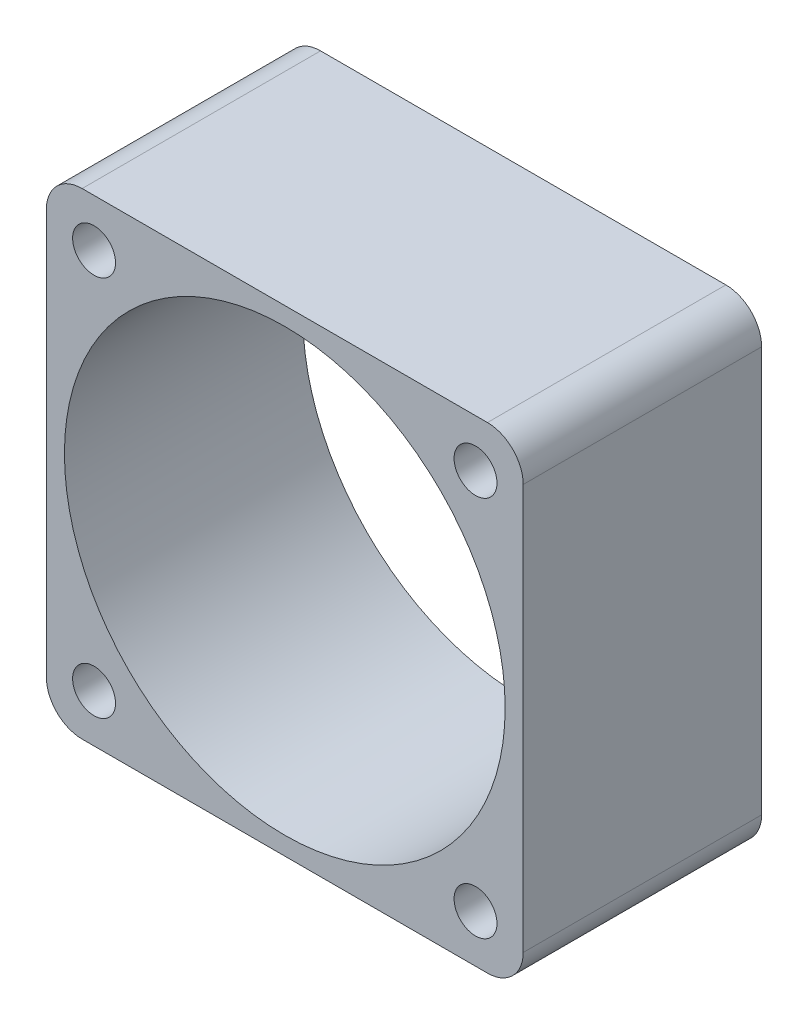
ISO-10303-21;
HEADER;
FILE_DESCRIPTION(('STEP AP214'),'2;1');
FILE_NAME('part.step','',(''),(''),'','','');
FILE_SCHEMA(('AUTOMOTIVE_DESIGN { 1 0 10303 214 1 1 1 1 }'));
ENDSEC;
DATA;
#1=APPLICATION_CONTEXT('core data for automotive mechanical design processes');
#2=APPLICATION_PROTOCOL_DEFINITION('international standard','automotive_design',2000,#1);
#3=PRODUCT_CONTEXT('',#1,'mechanical');
#4=PRODUCT('Part','Part','',(#3));
#5=PRODUCT_RELATED_PRODUCT_CATEGORY('part','',(#4));
#6=PRODUCT_DEFINITION_FORMATION('','',#4);
#7=PRODUCT_DEFINITION_CONTEXT('part definition',#1,'design');
#8=PRODUCT_DEFINITION('design','',#6,#7);
#9=PRODUCT_DEFINITION_SHAPE('','',#8);
#10=(LENGTH_UNIT() NAMED_UNIT(*) SI_UNIT(.MILLI.,.METRE.));
#11=(NAMED_UNIT(*) PLANE_ANGLE_UNIT() SI_UNIT($,.RADIAN.));
#12=(NAMED_UNIT(*) SI_UNIT($,.STERADIAN.) SOLID_ANGLE_UNIT());
#13=UNCERTAINTY_MEASURE_WITH_UNIT(LENGTH_MEASURE(1.E-05),#10,'distance_accuracy_value','');
#14=(GEOMETRIC_REPRESENTATION_CONTEXT(3) GLOBAL_UNCERTAINTY_ASSIGNED_CONTEXT((#13)) GLOBAL_UNIT_ASSIGNED_CONTEXT((#10,
#11,#12)) REPRESENTATION_CONTEXT('',''));
#15=CARTESIAN_POINT('',(0.,0.,0.));
#16=DIRECTION('',(0.,0.,1.));
#17=DIRECTION('',(1.,0.,0.));
#18=AXIS2_PLACEMENT_3D('',#15,#16,#17);
#19=CARTESIAN_POINT('',(0.,0.,20.));
#20=DIRECTION('',(0.,0.,-1.));
#21=DIRECTION('',(-1.,0.,0.));
#22=AXIS2_PLACEMENT_3D('',#19,#20,#21);
#23=PLANE('',#22);
#24=DIRECTION('',(1.,0.,0.));
#25=VECTOR('',#24,1.);
#26=CARTESIAN_POINT('',(-20.,-20.,20.));
#27=LINE('',#26,#25);
#28=CARTESIAN_POINT('',(-17.,-20.,20.));
#29=VERTEX_POINT('',#28);
#30=CARTESIAN_POINT('',(17.,-20.,20.));
#31=VERTEX_POINT('',#30);
#32=EDGE_CURVE('E136',#29,#31,#27,.T.);
#33=ORIENTED_EDGE('',*,*,#32,.T.);
#34=CARTESIAN_POINT('',(17.,-17.,20.));
#35=DIRECTION('',(0.,0.,-1.));
#36=DIRECTION('',(-1.,0.,0.));
#37=AXIS2_PLACEMENT_3D('',#34,#35,#36);
#38=CIRCLE('',#37,3.);
#39=CARTESIAN_POINT('',(20.,-17.,20.));
#40=VERTEX_POINT('',#39);
#41=EDGE_CURVE('E155',#31,#40,#38,.F.);
#42=ORIENTED_EDGE('',*,*,#41,.T.);
#43=DIRECTION('',(0.,1.,0.));
#44=VECTOR('',#43,1.);
#45=CARTESIAN_POINT('',(20.,-20.,20.));
#46=LINE('',#45,#44);
#47=CARTESIAN_POINT('',(20.,17.,20.));
#48=VERTEX_POINT('',#47);
#49=EDGE_CURVE('E119',#40,#48,#46,.T.);
#50=ORIENTED_EDGE('',*,*,#49,.T.);
#51=CARTESIAN_POINT('',(17.,17.,20.));
#52=DIRECTION('',(0.,0.,-1.));
#53=DIRECTION('',(-1.,0.,0.));
#54=AXIS2_PLACEMENT_3D('',#51,#52,#53);
#55=CIRCLE('',#54,3.);
#56=CARTESIAN_POINT('',(17.,20.,20.));
#57=VERTEX_POINT('',#56);
#58=EDGE_CURVE('E150',#48,#57,#55,.F.);
#59=ORIENTED_EDGE('',*,*,#58,.T.);
#60=DIRECTION('',(-1.,0.,0.));
#61=VECTOR('',#60,1.);
#62=CARTESIAN_POINT('',(-20.,20.,20.));
#63=LINE('',#62,#61);
#64=CARTESIAN_POINT('',(-17.,20.,20.));
#65=VERTEX_POINT('',#64);
#66=EDGE_CURVE('E166',#57,#65,#63,.T.);
#67=ORIENTED_EDGE('',*,*,#66,.T.);
#68=CARTESIAN_POINT('',(-17.,17.,20.));
#69=DIRECTION('',(0.,0.,-1.));
#70=DIRECTION('',(-1.,0.,0.));
#71=AXIS2_PLACEMENT_3D('',#68,#69,#70);
#72=CIRCLE('',#71,3.);
#73=CARTESIAN_POINT('',(-20.,17.,20.));
#74=VERTEX_POINT('',#73);
#75=EDGE_CURVE('E55',#65,#74,#72,.F.);
#76=ORIENTED_EDGE('',*,*,#75,.T.);
#77=DIRECTION('',(0.,-1.,0.));
#78=VECTOR('',#77,1.);
#79=CARTESIAN_POINT('',(-20.,-20.,20.));
#80=LINE('',#79,#78);
#81=CARTESIAN_POINT('',(-20.,-17.,20.));
#82=VERTEX_POINT('',#81);
#83=EDGE_CURVE('E174',#74,#82,#80,.T.);
#84=ORIENTED_EDGE('',*,*,#83,.T.);
#85=CARTESIAN_POINT('',(-17.,-17.,20.));
#86=DIRECTION('',(0.,0.,-1.));
#87=DIRECTION('',(-1.,0.,0.));
#88=AXIS2_PLACEMENT_3D('',#85,#86,#87);
#89=CIRCLE('',#88,3.);
#90=EDGE_CURVE('E153',#82,#29,#89,.F.);
#91=ORIENTED_EDGE('',*,*,#90,.T.);
#92=EDGE_LOOP('',(#33,#42,#50,#59,#67,#76,#84,#91));
#93=FACE_BOUND('',#92,.T.);
#94=CARTESIAN_POINT('',(-16.,16.,20.));
#95=DIRECTION('',(0.,0.,1.));
#96=DIRECTION('',(1.,0.,0.));
#97=AXIS2_PLACEMENT_3D('',#94,#95,#96);
#98=CIRCLE('',#97,1.8);
#99=CARTESIAN_POINT('',(-14.2,16.,20.));
#100=VERTEX_POINT('',#99);
#101=EDGE_CURVE('E127',#100,#100,#98,.T.);
#102=ORIENTED_EDGE('',*,*,#101,.F.);
#103=EDGE_LOOP('',(#102));
#104=FACE_BOUND('',#103,.T.);
#105=CARTESIAN_POINT('',(0.,0.,20.));
#106=DIRECTION('',(0.,0.,1.));
#107=DIRECTION('',(1.,0.,0.));
#108=AXIS2_PLACEMENT_3D('',#105,#106,#107);
#109=CIRCLE('',#108,18.4844631894181);
#110=CARTESIAN_POINT('',(18.4844631894181,0.,20.));
#111=VERTEX_POINT('',#110);
#112=EDGE_CURVE('E181',#111,#111,#109,.T.);
#113=ORIENTED_EDGE('',*,*,#112,.F.);
#114=EDGE_LOOP('',(#113));
#115=FACE_BOUND('',#114,.T.);
#116=CARTESIAN_POINT('',(16.,16.0000000000009,20.));
#117=DIRECTION('',(0.,0.,1.));
#118=DIRECTION('',(1.,0.,0.));
#119=AXIS2_PLACEMENT_3D('',#116,#117,#118);
#120=CIRCLE('',#119,1.80000000000092);
#121=CARTESIAN_POINT('',(17.8000000000009,16.0000000000009,20.));
#122=VERTEX_POINT('',#121);
#123=EDGE_CURVE('E186',#122,#122,#120,.T.);
#124=ORIENTED_EDGE('',*,*,#123,.F.);
#125=EDGE_LOOP('',(#124));
#126=FACE_BOUND('',#125,.T.);
#127=CARTESIAN_POINT('',(16.0000000000009,-15.9999999999991,20.));
#128=DIRECTION('',(0.,0.,1.));
#129=DIRECTION('',(1.,0.,0.));
#130=AXIS2_PLACEMENT_3D('',#127,#128,#129);
#131=CIRCLE('',#130,1.80000000000125);
#132=CARTESIAN_POINT('',(17.8000000000022,-15.9999999999991,20.));
#133=VERTEX_POINT('',#132);
#134=EDGE_CURVE('E192',#133,#133,#131,.T.);
#135=ORIENTED_EDGE('',*,*,#134,.F.);
#136=EDGE_LOOP('',(#135));
#137=FACE_BOUND('',#136,.T.);
#138=CARTESIAN_POINT('',(-15.9999999999991,-16.,20.));
#139=DIRECTION('',(0.,0.,1.));
#140=DIRECTION('',(1.,0.,0.));
#141=AXIS2_PLACEMENT_3D('',#138,#139,#140);
#142=CIRCLE('',#141,1.80000000000047);
#143=CARTESIAN_POINT('',(-14.1999999999986,-16.,20.));
#144=VERTEX_POINT('',#143);
#145=EDGE_CURVE('E198',#144,#144,#142,.T.);
#146=ORIENTED_EDGE('',*,*,#145,.F.);
#147=EDGE_LOOP('',(#146));
#148=FACE_BOUND('',#147,.T.);
#149=ADVANCED_FACE('F33',(#93,#104,#115,#126,#137,#148),#23,.F.);
#150=CARTESIAN_POINT('',(0.,0.,0.));
#151=DIRECTION('',(0.,0.,-1.));
#152=DIRECTION('',(-1.,0.,0.));
#153=AXIS2_PLACEMENT_3D('',#150,#151,#152);
#154=PLANE('',#153);
#155=CARTESIAN_POINT('',(16.0000000000009,-15.9999999999991,0.));
#156=DIRECTION('',(0.,0.,1.));
#157=DIRECTION('',(1.,0.,0.));
#158=AXIS2_PLACEMENT_3D('',#155,#156,#157);
#159=CIRCLE('',#158,1.80000000000125);
#160=CARTESIAN_POINT('',(17.8000000000022,-15.9999999999991,0.));
#161=VERTEX_POINT('',#160);
#162=EDGE_CURVE('E195',#161,#161,#159,.T.);
#163=ORIENTED_EDGE('',*,*,#162,.T.);
#164=EDGE_LOOP('',(#163));
#165=FACE_BOUND('',#164,.T.);
#166=CARTESIAN_POINT('',(0.,0.,0.));
#167=DIRECTION('',(0.,0.,1.));
#168=DIRECTION('',(1.,0.,0.));
#169=AXIS2_PLACEMENT_3D('',#166,#167,#168);
#170=CIRCLE('',#169,18.4844631894181);
#171=CARTESIAN_POINT('',(18.4844631894181,0.,0.));
#172=VERTEX_POINT('',#171);
#173=EDGE_CURVE('E183',#172,#172,#170,.T.);
#174=ORIENTED_EDGE('',*,*,#173,.T.);
#175=EDGE_LOOP('',(#174));
#176=FACE_BOUND('',#175,.T.);
#177=DIRECTION('',(0.,1.,0.));
#178=VECTOR('',#177,1.);
#179=CARTESIAN_POINT('',(20.,-20.,0.));
#180=LINE('',#179,#178);
#181=CARTESIAN_POINT('',(20.,-17.,0.));
#182=VERTEX_POINT('',#181);
#183=CARTESIAN_POINT('',(20.,17.,0.));
#184=VERTEX_POINT('',#183);
#185=EDGE_CURVE('E116',#182,#184,#180,.T.);
#186=ORIENTED_EDGE('',*,*,#185,.F.);
#187=CARTESIAN_POINT('',(17.,-17.,0.));
#188=DIRECTION('',(0.,0.,-1.));
#189=DIRECTION('',(-1.,0.,0.));
#190=AXIS2_PLACEMENT_3D('',#187,#188,#189);
#191=CIRCLE('',#190,3.);
#192=CARTESIAN_POINT('',(17.,-20.,0.));
#193=VERTEX_POINT('',#192);
#194=EDGE_CURVE('E99',#182,#193,#191,.T.);
#195=ORIENTED_EDGE('',*,*,#194,.T.);
#196=DIRECTION('',(1.,0.,0.));
#197=VECTOR('',#196,1.);
#198=CARTESIAN_POINT('',(-20.,-20.,0.));
#199=LINE('',#198,#197);
#200=CARTESIAN_POINT('',(-17.,-20.,0.));
#201=VERTEX_POINT('',#200);
#202=EDGE_CURVE('E140',#201,#193,#199,.T.);
#203=ORIENTED_EDGE('',*,*,#202,.F.);
#204=CARTESIAN_POINT('',(-17.,-17.,0.));
#205=DIRECTION('',(0.,0.,-1.));
#206=DIRECTION('',(-1.,0.,0.));
#207=AXIS2_PLACEMENT_3D('',#204,#205,#206);
#208=CIRCLE('',#207,3.);
#209=CARTESIAN_POINT('',(-20.,-17.,0.));
#210=VERTEX_POINT('',#209);
#211=EDGE_CURVE('E110',#201,#210,#208,.T.);
#212=ORIENTED_EDGE('',*,*,#211,.T.);
#213=DIRECTION('',(0.,-1.,0.));
#214=VECTOR('',#213,1.);
#215=CARTESIAN_POINT('',(-20.,-20.,0.));
#216=LINE('',#215,#214);
#217=CARTESIAN_POINT('',(-20.,17.,0.));
#218=VERTEX_POINT('',#217);
#219=EDGE_CURVE('E130',#218,#210,#216,.T.);
#220=ORIENTED_EDGE('',*,*,#219,.F.);
#221=CARTESIAN_POINT('',(-17.,17.,0.));
#222=DIRECTION('',(0.,0.,-1.));
#223=DIRECTION('',(-1.,0.,0.));
#224=AXIS2_PLACEMENT_3D('',#221,#222,#223);
#225=CIRCLE('',#224,3.);
#226=CARTESIAN_POINT('',(-17.,20.,0.));
#227=VERTEX_POINT('',#226);
#228=EDGE_CURVE('E144',#218,#227,#225,.T.);
#229=ORIENTED_EDGE('',*,*,#228,.T.);
#230=DIRECTION('',(-1.,0.,0.));
#231=VECTOR('',#230,1.);
#232=CARTESIAN_POINT('',(-20.,20.,0.));
#233=LINE('',#232,#231);
#234=CARTESIAN_POINT('',(17.,20.,0.));
#235=VERTEX_POINT('',#234);
#236=EDGE_CURVE('E126',#235,#227,#233,.T.);
#237=ORIENTED_EDGE('',*,*,#236,.F.);
#238=CARTESIAN_POINT('',(17.,17.,0.));
#239=DIRECTION('',(0.,0.,-1.));
#240=DIRECTION('',(-1.,0.,0.));
#241=AXIS2_PLACEMENT_3D('',#238,#239,#240);
#242=CIRCLE('',#241,3.);
#243=EDGE_CURVE('E120',#235,#184,#242,.T.);
#244=ORIENTED_EDGE('',*,*,#243,.T.);
#245=EDGE_LOOP('',(#186,#195,#203,#212,#220,#229,#237,#244));
#246=FACE_BOUND('',#245,.T.);
#247=CARTESIAN_POINT('',(-16.,16.,0.));
#248=DIRECTION('',(0.,0.,1.));
#249=DIRECTION('',(1.,0.,0.));
#250=AXIS2_PLACEMENT_3D('',#247,#248,#249);
#251=CIRCLE('',#250,1.8);
#252=CARTESIAN_POINT('',(-14.2,16.,0.));
#253=VERTEX_POINT('',#252);
#254=EDGE_CURVE('E133',#253,#253,#251,.T.);
#255=ORIENTED_EDGE('',*,*,#254,.T.);
#256=EDGE_LOOP('',(#255));
#257=FACE_BOUND('',#256,.T.);
#258=CARTESIAN_POINT('',(16.,16.0000000000009,0.));
#259=DIRECTION('',(0.,0.,1.));
#260=DIRECTION('',(1.,0.,0.));
#261=AXIS2_PLACEMENT_3D('',#258,#259,#260);
#262=CIRCLE('',#261,1.80000000000092);
#263=CARTESIAN_POINT('',(17.8000000000009,16.0000000000009,0.));
#264=VERTEX_POINT('',#263);
#265=EDGE_CURVE('E189',#264,#264,#262,.T.);
#266=ORIENTED_EDGE('',*,*,#265,.T.);
#267=EDGE_LOOP('',(#266));
#268=FACE_BOUND('',#267,.T.);
#269=CARTESIAN_POINT('',(-15.9999999999991,-16.,0.));
#270=DIRECTION('',(0.,0.,1.));
#271=DIRECTION('',(1.,0.,0.));
#272=AXIS2_PLACEMENT_3D('',#269,#270,#271);
#273=CIRCLE('',#272,1.80000000000047);
#274=CARTESIAN_POINT('',(-14.1999999999986,-16.,0.));
#275=VERTEX_POINT('',#274);
#276=EDGE_CURVE('E201',#275,#275,#273,.T.);
#277=ORIENTED_EDGE('',*,*,#276,.T.);
#278=EDGE_LOOP('',(#277));
#279=FACE_BOUND('',#278,.T.);
#280=ADVANCED_FACE('F123',(#165,#176,#246,#257,#268,#279),#154,.T.);
#281=CARTESIAN_POINT('',(20.,-20.,20.));
#282=DIRECTION('',(-1.,0.,0.));
#283=DIRECTION('',(0.,0.,1.));
#284=AXIS2_PLACEMENT_3D('',#281,#282,#283);
#285=PLANE('',#284);
#286=ORIENTED_EDGE('',*,*,#49,.F.);
#287=DIRECTION('',(0.,0.,-1.));
#288=VECTOR('',#287,1.);
#289=CARTESIAN_POINT('',(20.,-17.,20.));
#290=LINE('',#289,#288);
#291=EDGE_CURVE('E103',#40,#182,#290,.T.);
#292=ORIENTED_EDGE('',*,*,#291,.T.);
#293=ORIENTED_EDGE('',*,*,#185,.T.);
#294=DIRECTION('',(0.,0.,-1.));
#295=VECTOR('',#294,1.);
#296=CARTESIAN_POINT('',(20.,17.,20.));
#297=LINE('',#296,#295);
#298=EDGE_CURVE('E121',#184,#48,#297,.F.);
#299=ORIENTED_EDGE('',*,*,#298,.T.);
#300=EDGE_LOOP('',(#286,#292,#293,#299));
#301=FACE_BOUND('',#300,.T.);
#302=ADVANCED_FACE('F115',(#301),#285,.F.);
#303=CARTESIAN_POINT('',(-20.,20.,20.));
#304=DIRECTION('',(0.,-1.,0.));
#305=DIRECTION('',(0.,0.,-1.));
#306=AXIS2_PLACEMENT_3D('',#303,#304,#305);
#307=PLANE('',#306);
#308=ORIENTED_EDGE('',*,*,#236,.T.);
#309=DIRECTION('',(0.,0.,-1.));
#310=VECTOR('',#309,1.);
#311=CARTESIAN_POINT('',(-17.,20.,20.));
#312=LINE('',#311,#310);
#313=EDGE_CURVE('E11',#227,#65,#312,.F.);
#314=ORIENTED_EDGE('',*,*,#313,.T.);
#315=ORIENTED_EDGE('',*,*,#66,.F.);
#316=DIRECTION('',(0.,0.,-1.));
#317=VECTOR('',#316,1.);
#318=CARTESIAN_POINT('',(17.,20.,20.));
#319=LINE('',#318,#317);
#320=EDGE_CURVE('E41',#57,#235,#319,.T.);
#321=ORIENTED_EDGE('',*,*,#320,.T.);
#322=EDGE_LOOP('',(#308,#314,#315,#321));
#323=FACE_BOUND('',#322,.T.);
#324=ADVANCED_FACE('F164',(#323),#307,.F.);
#325=CARTESIAN_POINT('',(-20.,-20.,20.));
#326=DIRECTION('',(1.,0.,0.));
#327=DIRECTION('',(0.,0.,-1.));
#328=AXIS2_PLACEMENT_3D('',#325,#326,#327);
#329=PLANE('',#328);
#330=ORIENTED_EDGE('',*,*,#219,.T.);
#331=DIRECTION('',(0.,0.,-1.));
#332=VECTOR('',#331,1.);
#333=CARTESIAN_POINT('',(-20.,-17.,20.));
#334=LINE('',#333,#332);
#335=EDGE_CURVE('E48',#210,#82,#334,.F.);
#336=ORIENTED_EDGE('',*,*,#335,.T.);
#337=ORIENTED_EDGE('',*,*,#83,.F.);
#338=DIRECTION('',(0.,0.,-1.));
#339=VECTOR('',#338,1.);
#340=CARTESIAN_POINT('',(-20.,17.,20.));
#341=LINE('',#340,#339);
#342=EDGE_CURVE('E157',#74,#218,#341,.T.);
#343=ORIENTED_EDGE('',*,*,#342,.T.);
#344=EDGE_LOOP('',(#330,#336,#337,#343));
#345=FACE_BOUND('',#344,.T.);
#346=ADVANCED_FACE('F173',(#345),#329,.F.);
#347=CARTESIAN_POINT('',(-20.,-20.,20.));
#348=DIRECTION('',(0.,1.,0.));
#349=DIRECTION('',(0.,0.,1.));
#350=AXIS2_PLACEMENT_3D('',#347,#348,#349);
#351=PLANE('',#350);
#352=ORIENTED_EDGE('',*,*,#202,.T.);
#353=DIRECTION('',(0.,0.,-1.));
#354=VECTOR('',#353,1.);
#355=CARTESIAN_POINT('',(17.,-20.,20.));
#356=LINE('',#355,#354);
#357=EDGE_CURVE('E104',#193,#31,#356,.F.);
#358=ORIENTED_EDGE('',*,*,#357,.T.);
#359=ORIENTED_EDGE('',*,*,#32,.F.);
#360=DIRECTION('',(0.,0.,-1.));
#361=VECTOR('',#360,1.);
#362=CARTESIAN_POINT('',(-17.,-20.,20.));
#363=LINE('',#362,#361);
#364=EDGE_CURVE('E109',#29,#201,#363,.T.);
#365=ORIENTED_EDGE('',*,*,#364,.T.);
#366=EDGE_LOOP('',(#352,#358,#359,#365));
#367=FACE_BOUND('',#366,.T.);
#368=ADVANCED_FACE('F223',(#367),#351,.F.);
#369=CARTESIAN_POINT('',(-16.,16.,20.));
#370=DIRECTION('',(0.,0.,-1.));
#371=DIRECTION('',(-1.,0.,0.));
#372=AXIS2_PLACEMENT_3D('',#369,#370,#371);
#373=CYLINDRICAL_SURFACE('',#372,1.8);
#374=ORIENTED_EDGE('',*,*,#101,.T.);
#375=EDGE_LOOP('',(#374));
#376=FACE_BOUND('',#375,.T.);
#377=ORIENTED_EDGE('',*,*,#254,.F.);
#378=EDGE_LOOP('',(#377));
#379=FACE_BOUND('',#378,.T.);
#380=ADVANCED_FACE('F220',(#376,#379),#373,.F.);
#381=CARTESIAN_POINT('',(0.,0.,20.));
#382=DIRECTION('',(0.,0.,-1.));
#383=DIRECTION('',(-1.,0.,0.));
#384=AXIS2_PLACEMENT_3D('',#381,#382,#383);
#385=CYLINDRICAL_SURFACE('',#384,18.4844631894181);
#386=ORIENTED_EDGE('',*,*,#112,.T.);
#387=EDGE_LOOP('',(#386));
#388=FACE_BOUND('',#387,.T.);
#389=ORIENTED_EDGE('',*,*,#173,.F.);
#390=EDGE_LOOP('',(#389));
#391=FACE_BOUND('',#390,.T.);
#392=ADVANCED_FACE('F308',(#388,#391),#385,.F.);
#393=CARTESIAN_POINT('',(16.,16.0000000000009,20.));
#394=DIRECTION('',(0.,0.,-1.));
#395=DIRECTION('',(-1.,0.,0.));
#396=AXIS2_PLACEMENT_3D('',#393,#394,#395);
#397=CYLINDRICAL_SURFACE('',#396,1.80000000000092);
#398=ORIENTED_EDGE('',*,*,#123,.T.);
#399=EDGE_LOOP('',(#398));
#400=FACE_BOUND('',#399,.T.);
#401=ORIENTED_EDGE('',*,*,#265,.F.);
#402=EDGE_LOOP('',(#401));
#403=FACE_BOUND('',#402,.T.);
#404=ADVANCED_FACE('F316',(#400,#403),#397,.F.);
#405=CARTESIAN_POINT('',(16.0000000000009,-15.9999999999991,20.));
#406=DIRECTION('',(0.,0.,-1.));
#407=DIRECTION('',(-1.,0.,0.));
#408=AXIS2_PLACEMENT_3D('',#405,#406,#407);
#409=CYLINDRICAL_SURFACE('',#408,1.80000000000125);
#410=ORIENTED_EDGE('',*,*,#134,.T.);
#411=EDGE_LOOP('',(#410));
#412=FACE_BOUND('',#411,.T.);
#413=ORIENTED_EDGE('',*,*,#162,.F.);
#414=EDGE_LOOP('',(#413));
#415=FACE_BOUND('',#414,.T.);
#416=ADVANCED_FACE('F324',(#412,#415),#409,.F.);
#417=CARTESIAN_POINT('',(-15.9999999999991,-16.,20.));
#418=DIRECTION('',(0.,0.,-1.));
#419=DIRECTION('',(-1.,0.,0.));
#420=AXIS2_PLACEMENT_3D('',#417,#418,#419);
#421=CYLINDRICAL_SURFACE('',#420,1.80000000000047);
#422=ORIENTED_EDGE('',*,*,#145,.T.);
#423=EDGE_LOOP('',(#422));
#424=FACE_BOUND('',#423,.T.);
#425=ORIENTED_EDGE('',*,*,#276,.F.);
#426=EDGE_LOOP('',(#425));
#427=FACE_BOUND('',#426,.T.);
#428=ADVANCED_FACE('F207',(#424,#427),#421,.F.);
#429=CARTESIAN_POINT('',(17.,-17.,20.));
#430=DIRECTION('',(0.,0.,-1.));
#431=DIRECTION('',(-1.,0.,0.));
#432=AXIS2_PLACEMENT_3D('',#429,#430,#431);
#433=CYLINDRICAL_SURFACE('',#432,3.);
#434=ORIENTED_EDGE('',*,*,#41,.F.);
#435=ORIENTED_EDGE('',*,*,#357,.F.);
#436=ORIENTED_EDGE('',*,*,#194,.F.);
#437=ORIENTED_EDGE('',*,*,#291,.F.);
#438=EDGE_LOOP('',(#434,#435,#436,#437));
#439=FACE_BOUND('',#438,.T.);
#440=ADVANCED_FACE('F102',(#439),#433,.T.);
#441=CARTESIAN_POINT('',(-17.,-17.,20.));
#442=DIRECTION('',(0.,0.,-1.));
#443=DIRECTION('',(-1.,0.,0.));
#444=AXIS2_PLACEMENT_3D('',#441,#442,#443);
#445=CYLINDRICAL_SURFACE('',#444,3.);
#446=ORIENTED_EDGE('',*,*,#90,.F.);
#447=ORIENTED_EDGE('',*,*,#335,.F.);
#448=ORIENTED_EDGE('',*,*,#211,.F.);
#449=ORIENTED_EDGE('',*,*,#364,.F.);
#450=EDGE_LOOP('',(#446,#447,#448,#449));
#451=FACE_BOUND('',#450,.T.);
#452=ADVANCED_FACE('F235',(#451),#445,.T.);
#453=CARTESIAN_POINT('',(-17.,17.,20.));
#454=DIRECTION('',(0.,0.,-1.));
#455=DIRECTION('',(-1.,0.,0.));
#456=AXIS2_PLACEMENT_3D('',#453,#454,#455);
#457=CYLINDRICAL_SURFACE('',#456,3.);
#458=ORIENTED_EDGE('',*,*,#75,.F.);
#459=ORIENTED_EDGE('',*,*,#313,.F.);
#460=ORIENTED_EDGE('',*,*,#228,.F.);
#461=ORIENTED_EDGE('',*,*,#342,.F.);
#462=EDGE_LOOP('',(#458,#459,#460,#461));
#463=FACE_BOUND('',#462,.T.);
#464=ADVANCED_FACE('F172',(#463),#457,.T.);
#465=CARTESIAN_POINT('',(17.,17.,20.));
#466=DIRECTION('',(0.,0.,-1.));
#467=DIRECTION('',(-1.,0.,0.));
#468=AXIS2_PLACEMENT_3D('',#465,#466,#467);
#469=CYLINDRICAL_SURFACE('',#468,3.);
#470=ORIENTED_EDGE('',*,*,#58,.F.);
#471=ORIENTED_EDGE('',*,*,#298,.F.);
#472=ORIENTED_EDGE('',*,*,#243,.F.);
#473=ORIENTED_EDGE('',*,*,#320,.F.);
#474=EDGE_LOOP('',(#470,#471,#472,#473));
#475=FACE_BOUND('',#474,.T.);
#476=ADVANCED_FACE('F35',(#475),#469,.T.);
#477=CLOSED_SHELL('',(#149,#280,#302,#324,#346,#368,#380,#392,#404,#416,#428,#440,#452,#464,#476));
#478=MANIFOLD_SOLID_BREP('B2',#477);
#479=ADVANCED_BREP_SHAPE_REPRESENTATION('',(#18,#478),#14);
#480=SHAPE_DEFINITION_REPRESENTATION(#9,#479);
ENDSEC;
END-ISO-10303-21;
